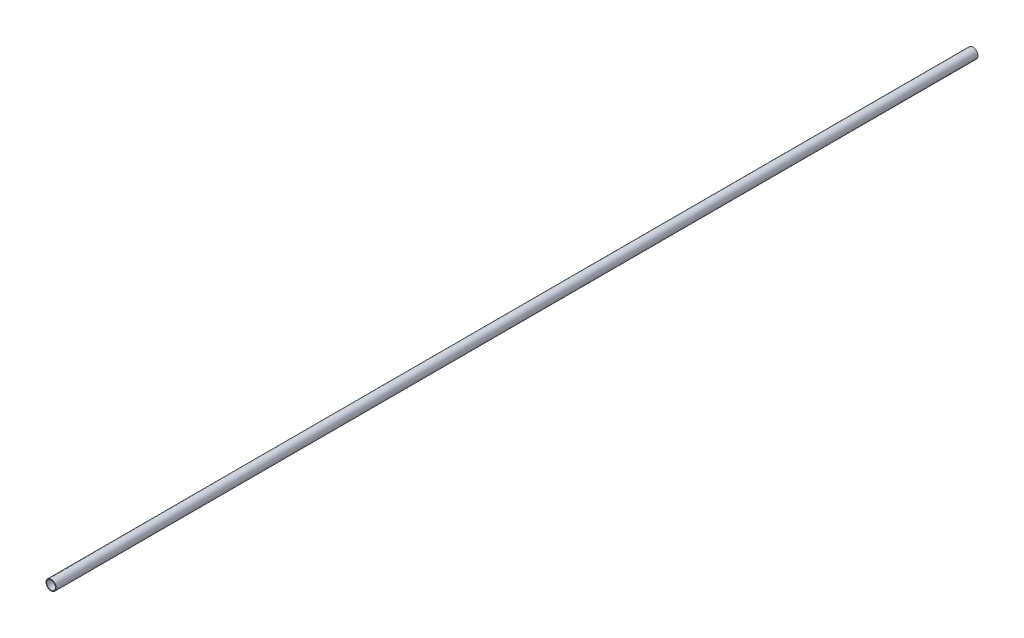
ISO-10303-21;
HEADER;
FILE_DESCRIPTION(('STEP AP214'),'2;1');
FILE_NAME('part.step','',(''),(''),'','','');
FILE_SCHEMA(('AUTOMOTIVE_DESIGN { 1 0 10303 214 1 1 1 1 }'));
ENDSEC;
DATA;
#1=APPLICATION_CONTEXT('core data for automotive mechanical design processes');
#2=APPLICATION_PROTOCOL_DEFINITION('international standard','automotive_design',2000,#1);
#3=PRODUCT_CONTEXT('',#1,'mechanical');
#4=PRODUCT('Part','Part','',(#3));
#5=PRODUCT_RELATED_PRODUCT_CATEGORY('part','',(#4));
#6=PRODUCT_DEFINITION_FORMATION('','',#4);
#7=PRODUCT_DEFINITION_CONTEXT('part definition',#1,'design');
#8=PRODUCT_DEFINITION('design','',#6,#7);
#9=PRODUCT_DEFINITION_SHAPE('','',#8);
#10=(LENGTH_UNIT() NAMED_UNIT(*) SI_UNIT(.MILLI.,.METRE.));
#11=(NAMED_UNIT(*) PLANE_ANGLE_UNIT() SI_UNIT($,.RADIAN.));
#12=(NAMED_UNIT(*) SI_UNIT($,.STERADIAN.) SOLID_ANGLE_UNIT());
#13=UNCERTAINTY_MEASURE_WITH_UNIT(LENGTH_MEASURE(1.E-05),#10,'distance_accuracy_value','');
#14=(GEOMETRIC_REPRESENTATION_CONTEXT(3) GLOBAL_UNCERTAINTY_ASSIGNED_CONTEXT((#13)) GLOBAL_UNIT_ASSIGNED_CONTEXT((#10,
#11,#12)) REPRESENTATION_CONTEXT('',''));
#15=CARTESIAN_POINT('',(0.,0.,0.));
#16=DIRECTION('',(0.,0.,1.));
#17=DIRECTION('',(1.,0.,0.));
#18=AXIS2_PLACEMENT_3D('',#15,#16,#17);
#19=CARTESIAN_POINT('',(0.,0.,5486.4));
#20=DIRECTION('',(0.,0.,1.));
#21=DIRECTION('',(1.,0.,0.));
#22=AXIS2_PLACEMENT_3D('',#19,#20,#21);
#23=PLANE('',#22);
#24=CARTESIAN_POINT('',(0.,0.,5486.4));
#25=DIRECTION('',(0.,0.,1.));
#26=DIRECTION('',(1.,0.,0.));
#27=AXIS2_PLACEMENT_3D('',#24,#25,#26);
#28=CIRCLE('',#27,30.226);
#29=CARTESIAN_POINT('',(30.226,0.,5486.4));
#30=VERTEX_POINT('',#29);
#31=EDGE_CURVE('E10',#30,#30,#28,.T.);
#32=ORIENTED_EDGE('',*,*,#31,.T.);
#33=EDGE_LOOP('',(#32));
#34=FACE_BOUND('',#33,.T.);
#35=CARTESIAN_POINT('',(0.,0.,5486.4));
#36=DIRECTION('',(0.,0.,1.));
#37=DIRECTION('',(1.,0.,0.));
#38=AXIS2_PLACEMENT_3D('',#35,#36,#37);
#39=CIRCLE('',#38,26.3144);
#40=CARTESIAN_POINT('',(26.3144,0.,5486.4));
#41=VERTEX_POINT('',#40);
#42=EDGE_CURVE('E39',#41,#41,#39,.T.);
#43=ORIENTED_EDGE('',*,*,#42,.F.);
#44=EDGE_LOOP('',(#43));
#45=FACE_BOUND('',#44,.T.);
#46=ADVANCED_FACE('F28',(#34,#45),#23,.T.);
#47=CARTESIAN_POINT('',(0.,0.,0.));
#48=DIRECTION('',(0.,0.,1.));
#49=DIRECTION('',(1.,0.,0.));
#50=AXIS2_PLACEMENT_3D('',#47,#48,#49);
#51=PLANE('',#50);
#52=CARTESIAN_POINT('',(0.,0.,0.));
#53=DIRECTION('',(0.,0.,1.));
#54=DIRECTION('',(1.,0.,0.));
#55=AXIS2_PLACEMENT_3D('',#52,#53,#54);
#56=CIRCLE('',#55,30.226);
#57=CARTESIAN_POINT('',(30.226,0.,0.));
#58=VERTEX_POINT('',#57);
#59=EDGE_CURVE('E32',#58,#58,#56,.T.);
#60=ORIENTED_EDGE('',*,*,#59,.F.);
#61=EDGE_LOOP('',(#60));
#62=FACE_BOUND('',#61,.T.);
#63=CARTESIAN_POINT('',(0.,0.,0.));
#64=DIRECTION('',(0.,0.,1.));
#65=DIRECTION('',(1.,0.,0.));
#66=AXIS2_PLACEMENT_3D('',#63,#64,#65);
#67=CIRCLE('',#66,26.3144);
#68=CARTESIAN_POINT('',(26.3144,0.,0.));
#69=VERTEX_POINT('',#68);
#70=EDGE_CURVE('E41',#69,#69,#67,.T.);
#71=ORIENTED_EDGE('',*,*,#70,.T.);
#72=EDGE_LOOP('',(#71));
#73=FACE_BOUND('',#72,.T.);
#74=ADVANCED_FACE('F51',(#62,#73),#51,.F.);
#75=CARTESIAN_POINT('',(0.,0.,5486.4));
#76=DIRECTION('',(0.,0.,-1.));
#77=DIRECTION('',(-1.,0.,0.));
#78=AXIS2_PLACEMENT_3D('',#75,#76,#77);
#79=CYLINDRICAL_SURFACE('',#78,30.226);
#80=ORIENTED_EDGE('',*,*,#31,.F.);
#81=EDGE_LOOP('',(#80));
#82=FACE_BOUND('',#81,.T.);
#83=ORIENTED_EDGE('',*,*,#59,.T.);
#84=EDGE_LOOP('',(#83));
#85=FACE_BOUND('',#84,.T.);
#86=ADVANCED_FACE('F30',(#82,#85),#79,.T.);
#87=CARTESIAN_POINT('',(0.,0.,5486.4));
#88=DIRECTION('',(0.,0.,-1.));
#89=DIRECTION('',(-1.,0.,0.));
#90=AXIS2_PLACEMENT_3D('',#87,#88,#89);
#91=CYLINDRICAL_SURFACE('',#90,26.3144);
#92=ORIENTED_EDGE('',*,*,#42,.T.);
#93=EDGE_LOOP('',(#92));
#94=FACE_BOUND('',#93,.T.);
#95=ORIENTED_EDGE('',*,*,#70,.F.);
#96=EDGE_LOOP('',(#95));
#97=FACE_BOUND('',#96,.T.);
#98=ADVANCED_FACE('F47',(#94,#97),#91,.F.);
#99=CLOSED_SHELL('',(#46,#74,#86,#98));
#100=MANIFOLD_SOLID_BREP('B2',#99);
#101=ADVANCED_BREP_SHAPE_REPRESENTATION('',(#18,#100),#14);
#102=SHAPE_DEFINITION_REPRESENTATION(#9,#101);
ENDSEC;
END-ISO-10303-21;
